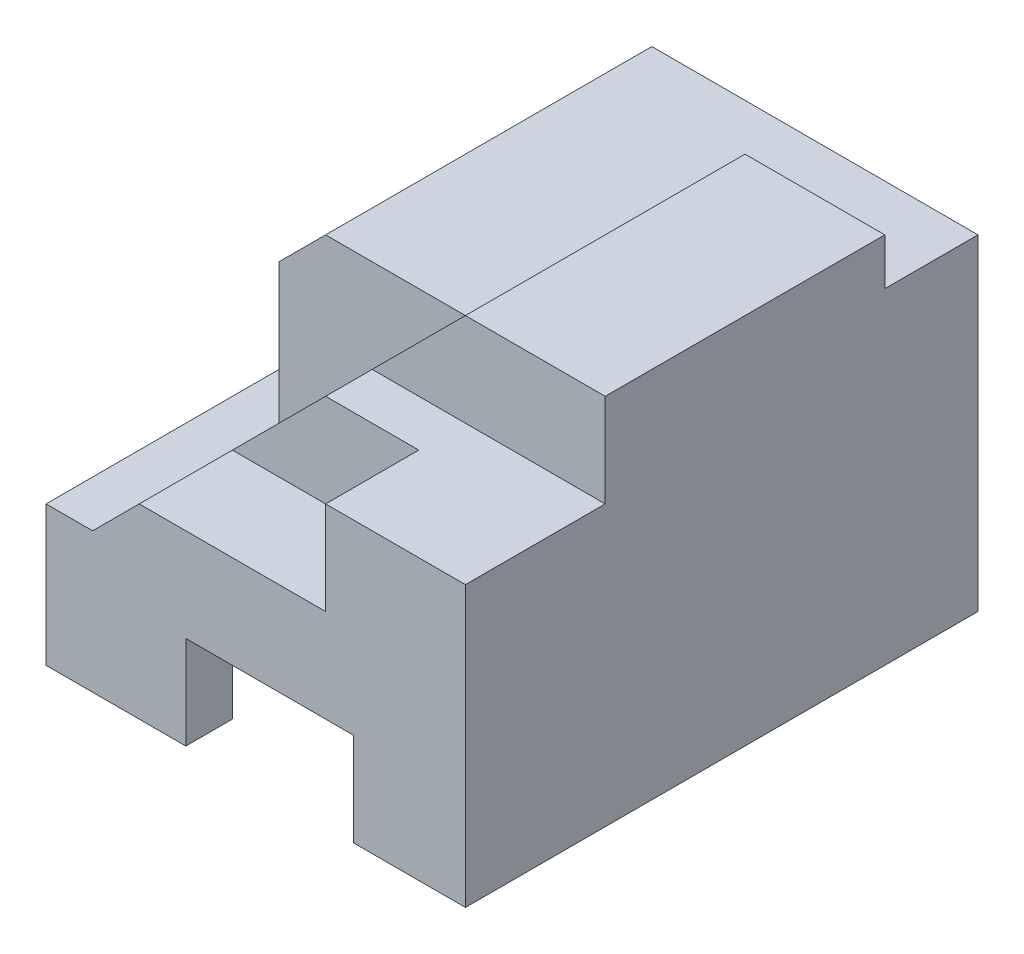
ISO-10303-21;
HEADER;
FILE_DESCRIPTION(('STEP AP214'),'2;1');
FILE_NAME('part.step','',(''),(''),'','','');
FILE_SCHEMA(('AUTOMOTIVE_DESIGN { 1 0 10303 214 1 1 1 1 }'));
ENDSEC;
DATA;
#1=APPLICATION_CONTEXT('core data for automotive mechanical design processes');
#2=APPLICATION_PROTOCOL_DEFINITION('international standard','automotive_design',2000,#1);
#3=PRODUCT_CONTEXT('',#1,'mechanical');
#4=PRODUCT('Part','Part','',(#3));
#5=PRODUCT_RELATED_PRODUCT_CATEGORY('part','',(#4));
#6=PRODUCT_DEFINITION_FORMATION('','',#4);
#7=PRODUCT_DEFINITION_CONTEXT('part definition',#1,'design');
#8=PRODUCT_DEFINITION('design','',#6,#7);
#9=PRODUCT_DEFINITION_SHAPE('','',#8);
#10=(LENGTH_UNIT() NAMED_UNIT(*) SI_UNIT(.MILLI.,.METRE.));
#11=(NAMED_UNIT(*) PLANE_ANGLE_UNIT() SI_UNIT($,.RADIAN.));
#12=(NAMED_UNIT(*) SI_UNIT($,.STERADIAN.) SOLID_ANGLE_UNIT());
#13=UNCERTAINTY_MEASURE_WITH_UNIT(LENGTH_MEASURE(1.E-05),#10,'distance_accuracy_value','');
#14=(GEOMETRIC_REPRESENTATION_CONTEXT(3) GLOBAL_UNCERTAINTY_ASSIGNED_CONTEXT((#13)) GLOBAL_UNIT_ASSIGNED_CONTEXT((#10,
#11,#12)) REPRESENTATION_CONTEXT('',''));
#15=CARTESIAN_POINT('',(0.,0.,0.));
#16=DIRECTION('',(0.,0.,1.));
#17=DIRECTION('',(1.,0.,0.));
#18=AXIS2_PLACEMENT_3D('',#15,#16,#17);
#19=CARTESIAN_POINT('',(0.,0.,11.));
#20=DIRECTION('',(0.,1.,0.));
#21=DIRECTION('',(0.,0.,1.));
#22=AXIS2_PLACEMENT_3D('',#19,#20,#21);
#23=PLANE('',#22);
#24=DIRECTION('',(0.,0.,-1.));
#25=VECTOR('',#24,1.);
#26=CARTESIAN_POINT('',(1.,0.,11.));
#27=LINE('',#26,#25);
#28=CARTESIAN_POINT('',(1.,0.,11.));
#29=VERTEX_POINT('',#28);
#30=CARTESIAN_POINT('',(1.,0.,10.));
#31=VERTEX_POINT('',#30);
#32=EDGE_CURVE('E217',#29,#31,#27,.T.);
#33=ORIENTED_EDGE('',*,*,#32,.T.);
#34=DIRECTION('',(-1.,0.,0.));
#35=VECTOR('',#34,1.);
#36=CARTESIAN_POINT('',(4.,0.,10.));
#37=LINE('',#36,#35);
#38=CARTESIAN_POINT('',(4.,0.,10.));
#39=VERTEX_POINT('',#38);
#40=EDGE_CURVE('E209',#39,#31,#37,.T.);
#41=ORIENTED_EDGE('',*,*,#40,.F.);
#42=DIRECTION('',(0.,0.,-1.));
#43=VECTOR('',#42,1.);
#44=CARTESIAN_POINT('',(4.,0.,11.));
#45=LINE('',#44,#43);
#46=CARTESIAN_POINT('',(4.,0.,11.));
#47=VERTEX_POINT('',#46);
#48=EDGE_CURVE('E479',#47,#39,#45,.T.);
#49=ORIENTED_EDGE('',*,*,#48,.F.);
#50=DIRECTION('',(1.,0.,0.));
#51=VECTOR('',#50,1.);
#52=CARTESIAN_POINT('',(0.,0.,11.));
#53=LINE('',#52,#51);
#54=EDGE_CURVE('E329',#29,#47,#53,.T.);
#55=ORIENTED_EDGE('',*,*,#54,.F.);
#56=EDGE_LOOP('',(#33,#41,#49,#55));
#57=FACE_BOUND('',#56,.T.);
#58=ADVANCED_FACE('F32',(#57),#23,.F.);
#59=CARTESIAN_POINT('',(0.,0.,11.));
#60=DIRECTION('',(1.,0.,0.));
#61=DIRECTION('',(0.,0.,-1.));
#62=AXIS2_PLACEMENT_3D('',#59,#60,#61);
#63=PLANE('',#62);
#64=DIRECTION('',(0.,0.,-1.));
#65=VECTOR('',#64,1.);
#66=CARTESIAN_POINT('',(0.,0.,11.));
#67=LINE('',#66,#65);
#68=CARTESIAN_POINT('',(0.,0.,2.));
#69=VERTEX_POINT('',#68);
#70=CARTESIAN_POINT('',(0.,0.,0.));
#71=VERTEX_POINT('',#70);
#72=EDGE_CURVE('E348',#69,#71,#67,.T.);
#73=ORIENTED_EDGE('',*,*,#72,.F.);
#74=DIRECTION('',(0.,1.,0.));
#75=VECTOR('',#74,1.);
#76=CARTESIAN_POINT('',(0.,-4.,2.));
#77=LINE('',#76,#75);
#78=CARTESIAN_POINT('',(0.,3.,2.));
#79=VERTEX_POINT('',#78);
#80=EDGE_CURVE('E214',#69,#79,#77,.T.);
#81=ORIENTED_EDGE('',*,*,#80,.T.);
#82=DIRECTION('',(0.,-1.,0.));
#83=VECTOR('',#82,1.);
#84=CARTESIAN_POINT('',(0.,3.,2.));
#85=LINE('',#84,#83);
#86=CARTESIAN_POINT('',(0.,4.,2.));
#87=VERTEX_POINT('',#86);
#88=EDGE_CURVE('E244',#87,#79,#85,.T.);
#89=ORIENTED_EDGE('',*,*,#88,.F.);
#90=DIRECTION('',(0.,0.,1.));
#91=VECTOR('',#90,1.);
#92=CARTESIAN_POINT('',(0.,4.,0.));
#93=LINE('',#92,#91);
#94=CARTESIAN_POINT('',(0.,4.,0.));
#95=VERTEX_POINT('',#94);
#96=EDGE_CURVE('E232',#95,#87,#93,.T.);
#97=ORIENTED_EDGE('',*,*,#96,.F.);
#98=DIRECTION('',(0.,-1.,0.));
#99=VECTOR('',#98,1.);
#100=CARTESIAN_POINT('',(0.,0.,0.));
#101=LINE('',#100,#99);
#102=EDGE_CURVE('E328',#95,#71,#101,.T.);
#103=ORIENTED_EDGE('',*,*,#102,.T.);
#104=EDGE_LOOP('',(#73,#81,#89,#97,#103));
#105=FACE_BOUND('',#104,.T.);
#106=ADVANCED_FACE('F34',(#105),#63,.F.);
#107=CARTESIAN_POINT('',(0.,8.,11.));
#108=DIRECTION('',(0.,-1.,0.));
#109=DIRECTION('',(0.,0.,-1.));
#110=AXIS2_PLACEMENT_3D('',#107,#108,#109);
#111=PLANE('',#110);
#112=DIRECTION('',(-1.,0.,0.));
#113=VECTOR('',#112,1.);
#114=CARTESIAN_POINT('',(11.,8.,2.));
#115=LINE('',#114,#113);
#116=CARTESIAN_POINT('',(10.,8.,2.));
#117=VERTEX_POINT('',#116);
#118=CARTESIAN_POINT('',(7.,8.,2.));
#119=VERTEX_POINT('',#118);
#120=EDGE_CURVE('E317',#117,#119,#115,.T.);
#121=ORIENTED_EDGE('',*,*,#120,.T.);
#122=DIRECTION('',(0.,0.,1.));
#123=VECTOR('',#122,1.);
#124=CARTESIAN_POINT('',(7.,8.,7.));
#125=LINE('',#124,#123);
#126=CARTESIAN_POINT('',(7.,8.,8.));
#127=VERTEX_POINT('',#126);
#128=EDGE_CURVE('E269',#119,#127,#125,.T.);
#129=ORIENTED_EDGE('',*,*,#128,.T.);
#130=DIRECTION('',(-1.,0.,0.));
#131=VECTOR('',#130,1.);
#132=CARTESIAN_POINT('',(11.,8.,8.));
#133=LINE('',#132,#131);
#134=CARTESIAN_POINT('',(10.,8.,8.));
#135=VERTEX_POINT('',#134);
#136=EDGE_CURVE('E300',#135,#127,#133,.T.);
#137=ORIENTED_EDGE('',*,*,#136,.F.);
#138=DIRECTION('',(0.,0.,-1.));
#139=VECTOR('',#138,1.);
#140=CARTESIAN_POINT('',(10.,8.,11.));
#141=LINE('',#140,#139);
#142=EDGE_CURVE('E336',#135,#117,#141,.T.);
#143=ORIENTED_EDGE('',*,*,#142,.T.);
#144=EDGE_LOOP('',(#121,#129,#137,#143));
#145=FACE_BOUND('',#144,.T.);
#146=ADVANCED_FACE('F384',(#145),#111,.F.);
#147=CARTESIAN_POINT('',(0.,0.,7.));
#148=DIRECTION('',(0.,0.,-1.));
#149=DIRECTION('',(-1.,0.,0.));
#150=AXIS2_PLACEMENT_3D('',#147,#148,#149);
#151=PLANE('',#150);
#152=DIRECTION('',(-1.,0.,0.));
#153=VECTOR('',#152,1.);
#154=CARTESIAN_POINT('',(0.,7.,7.));
#155=LINE('',#154,#153);
#156=CARTESIAN_POINT('',(6.,7.,7.));
#157=VERTEX_POINT('',#156);
#158=CARTESIAN_POINT('',(3.,7.,7.));
#159=VERTEX_POINT('',#158);
#160=EDGE_CURVE('E254',#157,#159,#155,.T.);
#161=ORIENTED_EDGE('',*,*,#160,.T.);
#162=DIRECTION('',(0.707106781186548,0.707106781186548,0.));
#163=VECTOR('',#162,1.);
#164=CARTESIAN_POINT('',(3.,7.,7.));
#165=LINE('',#164,#163);
#166=CARTESIAN_POINT('',(2.,6.,7.));
#167=VERTEX_POINT('',#166);
#168=EDGE_CURVE('E228',#167,#159,#165,.T.);
#169=ORIENTED_EDGE('',*,*,#168,.F.);
#170=DIRECTION('',(0.,-1.,0.));
#171=VECTOR('',#170,1.);
#172=CARTESIAN_POINT('',(2.,3.,7.));
#173=LINE('',#172,#171);
#174=CARTESIAN_POINT('',(2.,3.,7.));
#175=VERTEX_POINT('',#174);
#176=EDGE_CURVE('E267',#167,#175,#173,.T.);
#177=ORIENTED_EDGE('',*,*,#176,.T.);
#178=DIRECTION('',(0.707106781186547,0.707106781186548,0.));
#179=VECTOR('',#178,1.);
#180=CARTESIAN_POINT('',(7.,8.,7.));
#181=LINE('',#180,#179);
#182=EDGE_CURVE('E264',#175,#157,#181,.T.);
#183=ORIENTED_EDGE('',*,*,#182,.T.);
#184=EDGE_LOOP('',(#161,#169,#177,#183));
#185=FACE_BOUND('',#184,.T.);
#186=ADVANCED_FACE('F416',(#185),#151,.F.);
#187=CARTESIAN_POINT('',(11.,6.,11.));
#188=DIRECTION('',(0.,-1.,0.));
#189=DIRECTION('',(0.,0.,-1.));
#190=AXIS2_PLACEMENT_3D('',#187,#188,#189);
#191=PLANE('',#190);
#192=DIRECTION('',(-1.,0.,0.));
#193=VECTOR('',#192,1.);
#194=CARTESIAN_POINT('',(11.,6.,8.));
#195=LINE('',#194,#193);
#196=CARTESIAN_POINT('',(10.,6.,8.));
#197=VERTEX_POINT('',#196);
#198=CARTESIAN_POINT('',(5.,6.,8.));
#199=VERTEX_POINT('',#198);
#200=EDGE_CURVE('E305',#197,#199,#195,.T.);
#201=ORIENTED_EDGE('',*,*,#200,.T.);
#202=DIRECTION('',(0.,0.,1.));
#203=VECTOR('',#202,1.);
#204=CARTESIAN_POINT('',(5.,6.,11.));
#205=LINE('',#204,#203);
#206=CARTESIAN_POINT('',(5.,6.,9.));
#207=VERTEX_POINT('',#206);
#208=EDGE_CURVE('E274',#199,#207,#205,.T.);
#209=ORIENTED_EDGE('',*,*,#208,.T.);
#210=DIRECTION('',(-1.,0.,0.));
#211=VECTOR('',#210,1.);
#212=CARTESIAN_POINT('',(0.,6.,9.));
#213=LINE('',#212,#211);
#214=CARTESIAN_POINT('',(7.,6.,9.));
#215=VERTEX_POINT('',#214);
#216=EDGE_CURVE('E283',#215,#207,#213,.T.);
#217=ORIENTED_EDGE('',*,*,#216,.F.);
#218=DIRECTION('',(0.,0.,1.));
#219=VECTOR('',#218,1.);
#220=CARTESIAN_POINT('',(7.,6.,9.));
#221=LINE('',#220,#219);
#222=CARTESIAN_POINT('',(7.,6.,11.));
#223=VERTEX_POINT('',#222);
#224=EDGE_CURVE('E297',#215,#223,#221,.T.);
#225=ORIENTED_EDGE('',*,*,#224,.T.);
#226=DIRECTION('',(-1.,0.,0.));
#227=VECTOR('',#226,1.);
#228=CARTESIAN_POINT('',(0.,6.,11.));
#229=LINE('',#228,#227);
#230=CARTESIAN_POINT('',(10.,6.,11.));
#231=VERTEX_POINT('',#230);
#232=EDGE_CURVE('E353',#231,#223,#229,.T.);
#233=ORIENTED_EDGE('',*,*,#232,.F.);
#234=DIRECTION('',(0.,0.,1.));
#235=VECTOR('',#234,1.);
#236=CARTESIAN_POINT('',(10.,6.,11.));
#237=LINE('',#236,#235);
#238=EDGE_CURVE('E308',#197,#231,#237,.T.);
#239=ORIENTED_EDGE('',*,*,#238,.F.);
#240=EDGE_LOOP('',(#201,#209,#217,#225,#233,#239));
#241=FACE_BOUND('',#240,.T.);
#242=ADVANCED_FACE('F362',(#241),#191,.F.);
#243=CARTESIAN_POINT('',(11.,8.,8.));
#244=DIRECTION('',(0.,0.,-1.));
#245=DIRECTION('',(-1.,0.,0.));
#246=AXIS2_PLACEMENT_3D('',#243,#244,#245);
#247=PLANE('',#246);
#248=ORIENTED_EDGE('',*,*,#136,.T.);
#249=DIRECTION('',(-0.707106781186548,-0.707106781186548,0.));
#250=VECTOR('',#249,1.);
#251=CARTESIAN_POINT('',(9.,10.,8.));
#252=LINE('',#251,#250);
#253=EDGE_CURVE('E279',#127,#199,#252,.T.);
#254=ORIENTED_EDGE('',*,*,#253,.T.);
#255=ORIENTED_EDGE('',*,*,#200,.F.);
#256=DIRECTION('',(0.,-1.,0.));
#257=VECTOR('',#256,1.);
#258=CARTESIAN_POINT('',(10.,0.,8.));
#259=LINE('',#258,#257);
#260=EDGE_CURVE('E313',#135,#197,#259,.T.);
#261=ORIENTED_EDGE('',*,*,#260,.F.);
#262=EDGE_LOOP('',(#248,#254,#255,#261));
#263=FACE_BOUND('',#262,.T.);
#264=ADVANCED_FACE('F380',(#263),#247,.F.);
#265=CARTESIAN_POINT('',(0.,0.,11.));
#266=DIRECTION('',(0.,0.,-1.));
#267=DIRECTION('',(-1.,0.,0.));
#268=AXIS2_PLACEMENT_3D('',#265,#266,#267);
#269=PLANE('',#268);
#270=ORIENTED_EDGE('',*,*,#54,.T.);
#271=DIRECTION('',(0.,-1.,0.));
#272=VECTOR('',#271,1.);
#273=CARTESIAN_POINT('',(4.,2.,11.));
#274=LINE('',#273,#272);
#275=CARTESIAN_POINT('',(4.,2.,11.));
#276=VERTEX_POINT('',#275);
#277=EDGE_CURVE('E465',#276,#47,#274,.T.);
#278=ORIENTED_EDGE('',*,*,#277,.F.);
#279=DIRECTION('',(-1.,0.,0.));
#280=VECTOR('',#279,1.);
#281=CARTESIAN_POINT('',(4.,2.,11.));
#282=LINE('',#281,#280);
#283=CARTESIAN_POINT('',(7.59510379149055,2.,11.));
#284=VERTEX_POINT('',#283);
#285=EDGE_CURVE('E474',#284,#276,#282,.T.);
#286=ORIENTED_EDGE('',*,*,#285,.F.);
#287=DIRECTION('',(0.,-1.,0.));
#288=VECTOR('',#287,1.);
#289=CARTESIAN_POINT('',(7.59510379149055,2.,11.));
#290=LINE('',#289,#288);
#291=CARTESIAN_POINT('',(7.59510379149055,0.,11.));
#292=VERTEX_POINT('',#291);
#293=EDGE_CURVE('E456',#284,#292,#290,.T.);
#294=ORIENTED_EDGE('',*,*,#293,.T.);
#295=CARTESIAN_POINT('',(10.,0.,11.));
#296=VERTEX_POINT('',#295);
#297=EDGE_CURVE('E333',#292,#296,#53,.T.);
#298=ORIENTED_EDGE('',*,*,#297,.T.);
#299=DIRECTION('',(0.,1.,0.));
#300=VECTOR('',#299,1.);
#301=CARTESIAN_POINT('',(10.,0.,11.));
#302=LINE('',#301,#300);
#303=EDGE_CURVE('E332',#296,#231,#302,.T.);
#304=ORIENTED_EDGE('',*,*,#303,.T.);
#305=ORIENTED_EDGE('',*,*,#232,.T.);
#306=DIRECTION('',(0.,-1.,0.));
#307=VECTOR('',#306,1.);
#308=CARTESIAN_POINT('',(7.,0.,11.));
#309=LINE('',#308,#307);
#310=CARTESIAN_POINT('',(7.,4.,11.));
#311=VERTEX_POINT('',#310);
#312=EDGE_CURVE('E287',#223,#311,#309,.T.);
#313=ORIENTED_EDGE('',*,*,#312,.T.);
#314=DIRECTION('',(-1.,0.,0.));
#315=VECTOR('',#314,1.);
#316=CARTESIAN_POINT('',(0.,4.,11.));
#317=LINE('',#316,#315);
#318=CARTESIAN_POINT('',(3.,4.,11.));
#319=VERTEX_POINT('',#318);
#320=EDGE_CURVE('E282',#311,#319,#317,.T.);
#321=ORIENTED_EDGE('',*,*,#320,.T.);
#322=DIRECTION('',(0.707106781186548,0.707106781186548,0.));
#323=VECTOR('',#322,1.);
#324=CARTESIAN_POINT('',(3.,4.,11.));
#325=LINE('',#324,#323);
#326=CARTESIAN_POINT('',(2.,3.,11.));
#327=VERTEX_POINT('',#326);
#328=EDGE_CURVE('E263',#327,#319,#325,.T.);
#329=ORIENTED_EDGE('',*,*,#328,.F.);
#330=DIRECTION('',(1.,0.,0.));
#331=VECTOR('',#330,1.);
#332=CARTESIAN_POINT('',(2.,3.,11.));
#333=LINE('',#332,#331);
#334=CARTESIAN_POINT('',(1.,3.,11.));
#335=VERTEX_POINT('',#334);
#336=EDGE_CURVE('E240',#335,#327,#333,.T.);
#337=ORIENTED_EDGE('',*,*,#336,.F.);
#338=DIRECTION('',(0.,1.,0.));
#339=VECTOR('',#338,1.);
#340=CARTESIAN_POINT('',(1.,-4.,11.));
#341=LINE('',#340,#339);
#342=EDGE_CURVE('E55',#29,#335,#341,.T.);
#343=ORIENTED_EDGE('',*,*,#342,.F.);
#344=EDGE_LOOP('',(#270,#278,#286,#294,#298,#304,#305,#313,#321,#329,#337,#343));
#345=FACE_BOUND('',#344,.T.);
#346=ADVANCED_FACE('F370',(#345),#269,.F.);
#347=ORIENTED_EDGE('',*,*,#297,.F.);
#348=DIRECTION('',(0.,0.,1.));
#349=VECTOR('',#348,1.);
#350=CARTESIAN_POINT('',(7.59510379149055,0.,11.));
#351=LINE('',#350,#349);
#352=CARTESIAN_POINT('',(7.59510379149055,0.,3.99999999999998));
#353=VERTEX_POINT('',#352);
#354=EDGE_CURVE('E449',#353,#292,#351,.T.);
#355=ORIENTED_EDGE('',*,*,#354,.F.);
#356=DIRECTION('',(1.,0.,0.));
#357=VECTOR('',#356,1.);
#358=CARTESIAN_POINT('',(2.,0.,3.99999999999998));
#359=LINE('',#358,#357);
#360=CARTESIAN_POINT('',(2.,0.,3.99999999999998));
#361=VERTEX_POINT('',#360);
#362=EDGE_CURVE('E451',#361,#353,#359,.T.);
#363=ORIENTED_EDGE('',*,*,#362,.F.);
#364=DIRECTION('',(-0.707106781186548,0.,-0.707106781186547));
#365=VECTOR('',#364,1.);
#366=CARTESIAN_POINT('',(4.5,0.,6.5));
#367=LINE('',#366,#365);
#368=EDGE_CURVE('E225',#361,#69,#367,.T.);
#369=ORIENTED_EDGE('',*,*,#368,.T.);
#370=ORIENTED_EDGE('',*,*,#72,.T.);
#371=DIRECTION('',(1.,0.,0.));
#372=VECTOR('',#371,1.);
#373=CARTESIAN_POINT('',(0.,0.,0.));
#374=LINE('',#373,#372);
#375=CARTESIAN_POINT('',(10.,0.,0.));
#376=VERTEX_POINT('',#375);
#377=EDGE_CURVE('E339',#71,#376,#374,.T.);
#378=ORIENTED_EDGE('',*,*,#377,.T.);
#379=DIRECTION('',(0.,0.,-1.));
#380=VECTOR('',#379,1.);
#381=CARTESIAN_POINT('',(10.,0.,11.));
#382=LINE('',#381,#380);
#383=EDGE_CURVE('E345',#296,#376,#382,.T.);
#384=ORIENTED_EDGE('',*,*,#383,.F.);
#385=EDGE_LOOP('',(#347,#355,#363,#369,#370,#378,#384));
#386=FACE_BOUND('',#385,.T.);
#387=ADVANCED_FACE('F433',(#386),#23,.F.);
#388=CARTESIAN_POINT('',(10.,0.,11.));
#389=DIRECTION('',(-1.,0.,0.));
#390=DIRECTION('',(0.,0.,1.));
#391=AXIS2_PLACEMENT_3D('',#388,#389,#390);
#392=PLANE('',#391);
#393=ORIENTED_EDGE('',*,*,#260,.T.);
#394=ORIENTED_EDGE('',*,*,#238,.T.);
#395=ORIENTED_EDGE('',*,*,#303,.F.);
#396=ORIENTED_EDGE('',*,*,#383,.T.);
#397=DIRECTION('',(0.,1.,0.));
#398=VECTOR('',#397,1.);
#399=CARTESIAN_POINT('',(10.,0.,0.));
#400=LINE('',#399,#398);
#401=CARTESIAN_POINT('',(10.,7.,0.));
#402=VERTEX_POINT('',#401);
#403=EDGE_CURVE('E341',#376,#402,#400,.T.);
#404=ORIENTED_EDGE('',*,*,#403,.T.);
#405=DIRECTION('',(0.,0.,1.));
#406=VECTOR('',#405,1.);
#407=CARTESIAN_POINT('',(10.,7.,11.));
#408=LINE('',#407,#406);
#409=CARTESIAN_POINT('',(10.,7.,2.));
#410=VERTEX_POINT('',#409);
#411=EDGE_CURVE('E320',#402,#410,#408,.T.);
#412=ORIENTED_EDGE('',*,*,#411,.T.);
#413=DIRECTION('',(0.,1.,0.));
#414=VECTOR('',#413,1.);
#415=CARTESIAN_POINT('',(10.,0.,2.));
#416=LINE('',#415,#414);
#417=EDGE_CURVE('E325',#410,#117,#416,.T.);
#418=ORIENTED_EDGE('',*,*,#417,.T.);
#419=ORIENTED_EDGE('',*,*,#142,.F.);
#420=EDGE_LOOP('',(#393,#394,#395,#396,#404,#412,#418,#419));
#421=FACE_BOUND('',#420,.T.);
#422=ADVANCED_FACE('F376',(#421),#392,.F.);
#423=CARTESIAN_POINT('',(0.,0.,0.));
#424=DIRECTION('',(0.,0.,-1.));
#425=DIRECTION('',(-1.,0.,0.));
#426=AXIS2_PLACEMENT_3D('',#423,#424,#425);
#427=PLANE('',#426);
#428=DIRECTION('',(0.707106781186548,0.707106781186548,0.));
#429=VECTOR('',#428,1.);
#430=CARTESIAN_POINT('',(3.,7.,0.));
#431=LINE('',#430,#429);
#432=CARTESIAN_POINT('',(3.,7.,0.));
#433=VERTEX_POINT('',#432);
#434=EDGE_CURVE('E229',#95,#433,#431,.T.);
#435=ORIENTED_EDGE('',*,*,#434,.T.);
#436=DIRECTION('',(-1.,0.,0.));
#437=VECTOR('',#436,1.);
#438=CARTESIAN_POINT('',(0.,7.,0.));
#439=LINE('',#438,#437);
#440=EDGE_CURVE('E350',#402,#433,#439,.T.);
#441=ORIENTED_EDGE('',*,*,#440,.F.);
#442=ORIENTED_EDGE('',*,*,#403,.F.);
#443=ORIENTED_EDGE('',*,*,#377,.F.);
#444=ORIENTED_EDGE('',*,*,#102,.F.);
#445=EDGE_LOOP('',(#435,#441,#442,#443,#444));
#446=FACE_BOUND('',#445,.T.);
#447=ADVANCED_FACE('F393',(#446),#427,.T.);
#448=CARTESIAN_POINT('',(11.,8.,2.));
#449=DIRECTION('',(0.,0.,1.));
#450=DIRECTION('',(1.,0.,0.));
#451=AXIS2_PLACEMENT_3D('',#448,#449,#450);
#452=PLANE('',#451);
#453=DIRECTION('',(-1.,0.,0.));
#454=VECTOR('',#453,1.);
#455=CARTESIAN_POINT('',(11.,7.,2.));
#456=LINE('',#455,#454);
#457=CARTESIAN_POINT('',(6.,7.,2.));
#458=VERTEX_POINT('',#457);
#459=EDGE_CURVE('E316',#410,#458,#456,.T.);
#460=ORIENTED_EDGE('',*,*,#459,.T.);
#461=DIRECTION('',(0.707106781186548,0.707106781186548,0.));
#462=VECTOR('',#461,1.);
#463=CARTESIAN_POINT('',(-0.5,0.5,2.));
#464=LINE('',#463,#462);
#465=EDGE_CURVE('E255',#458,#119,#464,.T.);
#466=ORIENTED_EDGE('',*,*,#465,.T.);
#467=ORIENTED_EDGE('',*,*,#120,.F.);
#468=ORIENTED_EDGE('',*,*,#417,.F.);
#469=EDGE_LOOP('',(#460,#466,#467,#468));
#470=FACE_BOUND('',#469,.T.);
#471=ADVANCED_FACE('F387',(#470),#452,.F.);
#472=CARTESIAN_POINT('',(11.,7.,0.));
#473=DIRECTION('',(0.,-1.,0.));
#474=DIRECTION('',(0.,0.,-1.));
#475=AXIS2_PLACEMENT_3D('',#472,#473,#474);
#476=PLANE('',#475);
#477=ORIENTED_EDGE('',*,*,#440,.T.);
#478=DIRECTION('',(0.,0.,1.));
#479=VECTOR('',#478,1.);
#480=CARTESIAN_POINT('',(3.,7.,0.));
#481=LINE('',#480,#479);
#482=EDGE_CURVE('E234',#433,#159,#481,.T.);
#483=ORIENTED_EDGE('',*,*,#482,.T.);
#484=ORIENTED_EDGE('',*,*,#160,.F.);
#485=DIRECTION('',(0.,0.,1.));
#486=VECTOR('',#485,1.);
#487=CARTESIAN_POINT('',(6.,7.,2.));
#488=LINE('',#487,#486);
#489=EDGE_CURVE('E258',#458,#157,#488,.T.);
#490=ORIENTED_EDGE('',*,*,#489,.F.);
#491=ORIENTED_EDGE('',*,*,#459,.F.);
#492=ORIENTED_EDGE('',*,*,#411,.F.);
#493=EDGE_LOOP('',(#477,#483,#484,#490,#491,#492));
#494=FACE_BOUND('',#493,.T.);
#495=ADVANCED_FACE('F391',(#494),#476,.F.);
#496=CARTESIAN_POINT('',(7.,0.,9.));
#497=DIRECTION('',(-1.,0.,0.));
#498=DIRECTION('',(0.,0.,1.));
#499=AXIS2_PLACEMENT_3D('',#496,#497,#498);
#500=PLANE('',#499);
#501=ORIENTED_EDGE('',*,*,#312,.F.);
#502=ORIENTED_EDGE('',*,*,#224,.F.);
#503=DIRECTION('',(0.,-1.,0.));
#504=VECTOR('',#503,1.);
#505=CARTESIAN_POINT('',(7.,0.,9.));
#506=LINE('',#505,#504);
#507=CARTESIAN_POINT('',(7.,4.,9.));
#508=VERTEX_POINT('',#507);
#509=EDGE_CURVE('E290',#215,#508,#506,.T.);
#510=ORIENTED_EDGE('',*,*,#509,.T.);
#511=DIRECTION('',(0.,0.,1.));
#512=VECTOR('',#511,1.);
#513=CARTESIAN_POINT('',(7.,4.,9.));
#514=LINE('',#513,#512);
#515=EDGE_CURVE('E301',#508,#311,#514,.T.);
#516=ORIENTED_EDGE('',*,*,#515,.T.);
#517=EDGE_LOOP('',(#501,#502,#510,#516));
#518=FACE_BOUND('',#517,.T.);
#519=ADVANCED_FACE('F368',(#518),#500,.T.);
#520=CARTESIAN_POINT('',(0.,4.,9.));
#521=DIRECTION('',(0.,1.,0.));
#522=DIRECTION('',(-1.,0.,0.));
#523=AXIS2_PLACEMENT_3D('',#520,#521,#522);
#524=PLANE('',#523);
#525=ORIENTED_EDGE('',*,*,#320,.F.);
#526=ORIENTED_EDGE('',*,*,#515,.F.);
#527=DIRECTION('',(-1.,0.,0.));
#528=VECTOR('',#527,1.);
#529=CARTESIAN_POINT('',(0.,4.,9.));
#530=LINE('',#529,#528);
#531=CARTESIAN_POINT('',(3.,4.,9.));
#532=VERTEX_POINT('',#531);
#533=EDGE_CURVE('E286',#508,#532,#530,.T.);
#534=ORIENTED_EDGE('',*,*,#533,.T.);
#535=DIRECTION('',(0.,0.,1.));
#536=VECTOR('',#535,1.);
#537=CARTESIAN_POINT('',(3.,4.,9.));
#538=LINE('',#537,#536);
#539=EDGE_CURVE('E292',#532,#319,#538,.T.);
#540=ORIENTED_EDGE('',*,*,#539,.T.);
#541=EDGE_LOOP('',(#525,#526,#534,#540));
#542=FACE_BOUND('',#541,.T.);
#543=ADVANCED_FACE('F421',(#542),#524,.T.);
#544=CARTESIAN_POINT('',(0.,0.,9.));
#545=DIRECTION('',(0.,0.,1.));
#546=DIRECTION('',(1.,0.,0.));
#547=AXIS2_PLACEMENT_3D('',#544,#545,#546);
#548=PLANE('',#547);
#549=DIRECTION('',(0.707106781186548,0.707106781186548,0.));
#550=VECTOR('',#549,1.);
#551=CARTESIAN_POINT('',(-0.499999999999999,0.499999999999999,9.));
#552=LINE('',#551,#550);
#553=EDGE_CURVE('E40',#532,#207,#552,.T.);
#554=ORIENTED_EDGE('',*,*,#553,.F.);
#555=ORIENTED_EDGE('',*,*,#533,.F.);
#556=ORIENTED_EDGE('',*,*,#509,.F.);
#557=ORIENTED_EDGE('',*,*,#216,.T.);
#558=EDGE_LOOP('',(#554,#555,#556,#557));
#559=FACE_BOUND('',#558,.T.);
#560=ADVANCED_FACE('F364',(#559),#548,.T.);
#561=CARTESIAN_POINT('',(3.,4.,7.));
#562=DIRECTION('',(0.707106781186547,-0.707106781186547,0.));
#563=DIRECTION('',(0.707106781186548,0.707106781186548,0.));
#564=AXIS2_PLACEMENT_3D('',#561,#562,#563);
#565=PLANE('',#564);
#566=ORIENTED_EDGE('',*,*,#128,.F.);
#567=ORIENTED_EDGE('',*,*,#465,.F.);
#568=ORIENTED_EDGE('',*,*,#489,.T.);
#569=ORIENTED_EDGE('',*,*,#182,.F.);
#570=DIRECTION('',(0.,0.,1.));
#571=VECTOR('',#570,1.);
#572=CARTESIAN_POINT('',(2.,3.,7.));
#573=LINE('',#572,#571);
#574=EDGE_CURVE('E271',#175,#327,#573,.T.);
#575=ORIENTED_EDGE('',*,*,#574,.T.);
#576=ORIENTED_EDGE('',*,*,#328,.T.);
#577=ORIENTED_EDGE('',*,*,#539,.F.);
#578=ORIENTED_EDGE('',*,*,#553,.T.);
#579=ORIENTED_EDGE('',*,*,#208,.F.);
#580=ORIENTED_EDGE('',*,*,#253,.F.);
#581=EDGE_LOOP('',(#566,#567,#568,#569,#575,#576,#577,#578,#579,#580));
#582=FACE_BOUND('',#581,.T.);
#583=ADVANCED_FACE('F357',(#582),#565,.F.);
#584=CARTESIAN_POINT('',(0.,0.,2.));
#585=DIRECTION('',(0.,0.,1.));
#586=DIRECTION('',(1.,0.,0.));
#587=AXIS2_PLACEMENT_3D('',#584,#585,#586);
#588=PLANE('',#587);
#589=DIRECTION('',(0.707106781186548,0.707106781186548,0.));
#590=VECTOR('',#589,1.);
#591=CARTESIAN_POINT('',(-2.,2.,2.));
#592=LINE('',#591,#590);
#593=CARTESIAN_POINT('',(2.,6.,2.));
#594=VERTEX_POINT('',#593);
#595=EDGE_CURVE('E237',#87,#594,#592,.T.);
#596=ORIENTED_EDGE('',*,*,#595,.F.);
#597=ORIENTED_EDGE('',*,*,#88,.T.);
#598=DIRECTION('',(1.,0.,0.));
#599=VECTOR('',#598,1.);
#600=CARTESIAN_POINT('',(2.,3.,2.));
#601=LINE('',#600,#599);
#602=CARTESIAN_POINT('',(2.,3.,2.));
#603=VERTEX_POINT('',#602);
#604=EDGE_CURVE('E247',#79,#603,#601,.T.);
#605=ORIENTED_EDGE('',*,*,#604,.T.);
#606=DIRECTION('',(0.,1.,0.));
#607=VECTOR('',#606,1.);
#608=CARTESIAN_POINT('',(2.,3.,2.));
#609=LINE('',#608,#607);
#610=EDGE_CURVE('E241',#603,#594,#609,.T.);
#611=ORIENTED_EDGE('',*,*,#610,.T.);
#612=EDGE_LOOP('',(#596,#597,#605,#611));
#613=FACE_BOUND('',#612,.T.);
#614=ADVANCED_FACE('F405',(#613),#588,.T.);
#615=CARTESIAN_POINT('',(2.,3.,2.));
#616=DIRECTION('',(1.,0.,0.));
#617=DIRECTION('',(0.,0.,-1.));
#618=AXIS2_PLACEMENT_3D('',#615,#616,#617);
#619=PLANE('',#618);
#620=ORIENTED_EDGE('',*,*,#176,.F.);
#621=DIRECTION('',(0.,0.,-1.));
#622=VECTOR('',#621,1.);
#623=CARTESIAN_POINT('',(2.,6.,2.));
#624=LINE('',#623,#622);
#625=EDGE_CURVE('E11',#167,#594,#624,.T.);
#626=ORIENTED_EDGE('',*,*,#625,.T.);
#627=ORIENTED_EDGE('',*,*,#610,.F.);
#628=DIRECTION('',(0.,0.,1.));
#629=VECTOR('',#628,1.);
#630=CARTESIAN_POINT('',(2.,3.,2.));
#631=LINE('',#630,#629);
#632=EDGE_CURVE('E250',#603,#175,#631,.T.);
#633=ORIENTED_EDGE('',*,*,#632,.T.);
#634=EDGE_LOOP('',(#620,#626,#627,#633));
#635=FACE_BOUND('',#634,.T.);
#636=ADVANCED_FACE('F413',(#635),#619,.F.);
#637=CARTESIAN_POINT('',(2.,3.,2.));
#638=DIRECTION('',(0.,-1.,0.));
#639=DIRECTION('',(0.,0.,-1.));
#640=AXIS2_PLACEMENT_3D('',#637,#638,#639);
#641=PLANE('',#640);
#642=ORIENTED_EDGE('',*,*,#604,.F.);
#643=DIRECTION('',(-0.707106781186548,0.,-0.707106781186547));
#644=VECTOR('',#643,1.);
#645=CARTESIAN_POINT('',(0.,3.,2.));
#646=LINE('',#645,#644);
#647=CARTESIAN_POINT('',(1.,3.,3.));
#648=VERTEX_POINT('',#647);
#649=EDGE_CURVE('E219',#648,#79,#646,.T.);
#650=ORIENTED_EDGE('',*,*,#649,.F.);
#651=DIRECTION('',(0.,0.,-1.));
#652=VECTOR('',#651,1.);
#653=CARTESIAN_POINT('',(1.,3.,3.));
#654=LINE('',#653,#652);
#655=EDGE_CURVE('E212',#335,#648,#654,.T.);
#656=ORIENTED_EDGE('',*,*,#655,.F.);
#657=ORIENTED_EDGE('',*,*,#336,.T.);
#658=ORIENTED_EDGE('',*,*,#574,.F.);
#659=ORIENTED_EDGE('',*,*,#632,.F.);
#660=EDGE_LOOP('',(#642,#650,#656,#657,#658,#659));
#661=FACE_BOUND('',#660,.T.);
#662=ADVANCED_FACE('F407',(#661),#641,.F.);
#663=CARTESIAN_POINT('',(3.,7.,0.));
#664=DIRECTION('',(0.707106781186547,-0.707106781186547,0.));
#665=DIRECTION('',(0.707106781186548,0.707106781186548,0.));
#666=AXIS2_PLACEMENT_3D('',#663,#664,#665);
#667=PLANE('',#666);
#668=ORIENTED_EDGE('',*,*,#595,.T.);
#669=ORIENTED_EDGE('',*,*,#625,.F.);
#670=ORIENTED_EDGE('',*,*,#168,.T.);
#671=ORIENTED_EDGE('',*,*,#482,.F.);
#672=ORIENTED_EDGE('',*,*,#434,.F.);
#673=ORIENTED_EDGE('',*,*,#96,.T.);
#674=EDGE_LOOP('',(#668,#669,#670,#671,#672,#673));
#675=FACE_BOUND('',#674,.T.);
#676=ADVANCED_FACE('F398',(#675),#667,.F.);
#677=CARTESIAN_POINT('',(0.,-4.,2.));
#678=DIRECTION('',(0.707106781186548,0.,-0.707106781186548));
#679=DIRECTION('',(-0.707106781186548,0.,-0.707106781186547));
#680=AXIS2_PLACEMENT_3D('',#677,#678,#679);
#681=PLANE('',#680);
#682=ORIENTED_EDGE('',*,*,#368,.F.);
#683=DIRECTION('',(0.,-1.,0.));
#684=VECTOR('',#683,1.);
#685=CARTESIAN_POINT('',(2.,2.,3.99999999999998));
#686=LINE('',#685,#684);
#687=CARTESIAN_POINT('',(2.,2.,3.99999999999998));
#688=VERTEX_POINT('',#687);
#689=EDGE_CURVE('E200',#688,#361,#686,.T.);
#690=ORIENTED_EDGE('',*,*,#689,.F.);
#691=DIRECTION('',(0.707106781186552,0.,0.707106781186543));
#692=VECTOR('',#691,1.);
#693=CARTESIAN_POINT('',(1.,2.,3.));
#694=LINE('',#693,#692);
#695=CARTESIAN_POINT('',(1.,2.,3.));
#696=VERTEX_POINT('',#695);
#697=EDGE_CURVE('E195',#696,#688,#694,.T.);
#698=ORIENTED_EDGE('',*,*,#697,.F.);
#699=DIRECTION('',(0.,1.,0.));
#700=VECTOR('',#699,1.);
#701=CARTESIAN_POINT('',(1.,-4.,3.));
#702=LINE('',#701,#700);
#703=EDGE_CURVE('E198',#696,#648,#702,.T.);
#704=ORIENTED_EDGE('',*,*,#703,.T.);
#705=ORIENTED_EDGE('',*,*,#649,.T.);
#706=ORIENTED_EDGE('',*,*,#80,.F.);
#707=EDGE_LOOP('',(#682,#690,#698,#704,#705,#706));
#708=FACE_BOUND('',#707,.T.);
#709=ADVANCED_FACE('F196',(#708),#681,.F.);
#710=CARTESIAN_POINT('',(1.,-4.,3.));
#711=DIRECTION('',(1.,0.,0.));
#712=DIRECTION('',(0.,0.,-1.));
#713=AXIS2_PLACEMENT_3D('',#710,#711,#712);
#714=PLANE('',#713);
#715=DIRECTION('',(0.,0.,-1.));
#716=VECTOR('',#715,1.);
#717=CARTESIAN_POINT('',(1.,2.,4.28648022869871));
#718=LINE('',#717,#716);
#719=CARTESIAN_POINT('',(1.,2.,10.));
#720=VERTEX_POINT('',#719);
#721=EDGE_CURVE('E204',#720,#696,#718,.T.);
#722=ORIENTED_EDGE('',*,*,#721,.F.);
#723=DIRECTION('',(0.,-1.,0.));
#724=VECTOR('',#723,1.);
#725=CARTESIAN_POINT('',(1.,2.,10.));
#726=LINE('',#725,#724);
#727=EDGE_CURVE('E462',#720,#31,#726,.T.);
#728=ORIENTED_EDGE('',*,*,#727,.T.);
#729=ORIENTED_EDGE('',*,*,#32,.F.);
#730=ORIENTED_EDGE('',*,*,#342,.T.);
#731=ORIENTED_EDGE('',*,*,#655,.T.);
#732=ORIENTED_EDGE('',*,*,#703,.F.);
#733=EDGE_LOOP('',(#722,#728,#729,#730,#731,#732));
#734=FACE_BOUND('',#733,.T.);
#735=ADVANCED_FACE('F211',(#734),#714,.F.);
#736=CARTESIAN_POINT('',(4.,2.,10.));
#737=DIRECTION('',(0.,0.,1.));
#738=DIRECTION('',(1.,0.,0.));
#739=AXIS2_PLACEMENT_3D('',#736,#737,#738);
#740=PLANE('',#739);
#741=ORIENTED_EDGE('',*,*,#40,.T.);
#742=ORIENTED_EDGE('',*,*,#727,.F.);
#743=DIRECTION('',(-1.,0.,0.));
#744=VECTOR('',#743,1.);
#745=CARTESIAN_POINT('',(4.,2.,10.));
#746=LINE('',#745,#744);
#747=CARTESIAN_POINT('',(4.,2.,10.));
#748=VERTEX_POINT('',#747);
#749=EDGE_CURVE('E47',#748,#720,#746,.T.);
#750=ORIENTED_EDGE('',*,*,#749,.F.);
#751=DIRECTION('',(0.,-1.,0.));
#752=VECTOR('',#751,1.);
#753=CARTESIAN_POINT('',(4.,2.,10.));
#754=LINE('',#753,#752);
#755=EDGE_CURVE('E463',#748,#39,#754,.T.);
#756=ORIENTED_EDGE('',*,*,#755,.T.);
#757=EDGE_LOOP('',(#741,#742,#750,#756));
#758=FACE_BOUND('',#757,.T.);
#759=ADVANCED_FACE('F493',(#758),#740,.F.);
#760=CARTESIAN_POINT('',(4.,2.,11.));
#761=DIRECTION('',(-1.,0.,0.));
#762=DIRECTION('',(0.,0.,1.));
#763=AXIS2_PLACEMENT_3D('',#760,#761,#762);
#764=PLANE('',#763);
#765=ORIENTED_EDGE('',*,*,#48,.T.);
#766=ORIENTED_EDGE('',*,*,#755,.F.);
#767=DIRECTION('',(0.,0.,-1.));
#768=VECTOR('',#767,1.);
#769=CARTESIAN_POINT('',(4.,2.,11.));
#770=LINE('',#769,#768);
#771=EDGE_CURVE('E458',#276,#748,#770,.T.);
#772=ORIENTED_EDGE('',*,*,#771,.F.);
#773=ORIENTED_EDGE('',*,*,#277,.T.);
#774=EDGE_LOOP('',(#765,#766,#772,#773));
#775=FACE_BOUND('',#774,.T.);
#776=ADVANCED_FACE('F490',(#775),#764,.F.);
#777=CARTESIAN_POINT('',(7.59510379149055,2.,11.));
#778=DIRECTION('',(1.,0.,0.));
#779=DIRECTION('',(0.,0.,-1.));
#780=AXIS2_PLACEMENT_3D('',#777,#778,#779);
#781=PLANE('',#780);
#782=ORIENTED_EDGE('',*,*,#354,.T.);
#783=ORIENTED_EDGE('',*,*,#293,.F.);
#784=DIRECTION('',(0.,0.,1.));
#785=VECTOR('',#784,1.);
#786=CARTESIAN_POINT('',(7.59510379149055,2.,3.99999999999998));
#787=LINE('',#786,#785);
#788=CARTESIAN_POINT('',(7.59510379149055,2.,3.99999999999998));
#789=VERTEX_POINT('',#788);
#790=EDGE_CURVE('E478',#789,#284,#787,.T.);
#791=ORIENTED_EDGE('',*,*,#790,.F.);
#792=DIRECTION('',(0.,-1.,0.));
#793=VECTOR('',#792,1.);
#794=CARTESIAN_POINT('',(7.59510379149055,2.,3.99999999999998));
#795=LINE('',#794,#793);
#796=EDGE_CURVE('E454',#789,#353,#795,.T.);
#797=ORIENTED_EDGE('',*,*,#796,.T.);
#798=EDGE_LOOP('',(#782,#783,#791,#797));
#799=FACE_BOUND('',#798,.T.);
#800=ADVANCED_FACE('F477',(#799),#781,.F.);
#801=CARTESIAN_POINT('',(2.,2.,3.99999999999998));
#802=DIRECTION('',(0.,0.,-1.));
#803=DIRECTION('',(-1.,0.,0.));
#804=AXIS2_PLACEMENT_3D('',#801,#802,#803);
#805=PLANE('',#804);
#806=ORIENTED_EDGE('',*,*,#362,.T.);
#807=ORIENTED_EDGE('',*,*,#796,.F.);
#808=DIRECTION('',(1.,0.,0.));
#809=VECTOR('',#808,1.);
#810=CARTESIAN_POINT('',(2.,2.,3.99999999999998));
#811=LINE('',#810,#809);
#812=EDGE_CURVE('E203',#688,#789,#811,.T.);
#813=ORIENTED_EDGE('',*,*,#812,.F.);
#814=ORIENTED_EDGE('',*,*,#689,.T.);
#815=EDGE_LOOP('',(#806,#807,#813,#814));
#816=FACE_BOUND('',#815,.T.);
#817=ADVANCED_FACE('F453',(#816),#805,.F.);
#818=CARTESIAN_POINT('',(0.,2.,0.));
#819=DIRECTION('',(0.,-1.,0.));
#820=DIRECTION('',(0.,0.,-1.));
#821=AXIS2_PLACEMENT_3D('',#818,#819,#820);
#822=PLANE('',#821);
#823=ORIENTED_EDGE('',*,*,#721,.T.);
#824=ORIENTED_EDGE('',*,*,#697,.T.);
#825=ORIENTED_EDGE('',*,*,#812,.T.);
#826=ORIENTED_EDGE('',*,*,#790,.T.);
#827=ORIENTED_EDGE('',*,*,#285,.T.);
#828=ORIENTED_EDGE('',*,*,#771,.T.);
#829=ORIENTED_EDGE('',*,*,#749,.T.);
#830=EDGE_LOOP('',(#823,#824,#825,#826,#827,#828,#829));
#831=FACE_BOUND('',#830,.T.);
#832=ADVANCED_FACE('F207',(#831),#822,.T.);
#833=CLOSED_SHELL('',(#58,#106,#146,#186,#242,#264,#346,#387,#422,#447,#471,#495,#519,#543,#560,
#583,#614,#636,#662,#676,#709,#735,#759,#776,#800,#817,#832));
#834=MANIFOLD_SOLID_BREP('B2',#833);
#835=ADVANCED_BREP_SHAPE_REPRESENTATION('',(#18,#834),#14);
#836=SHAPE_DEFINITION_REPRESENTATION(#9,#835);
ENDSEC;
END-ISO-10303-21;
